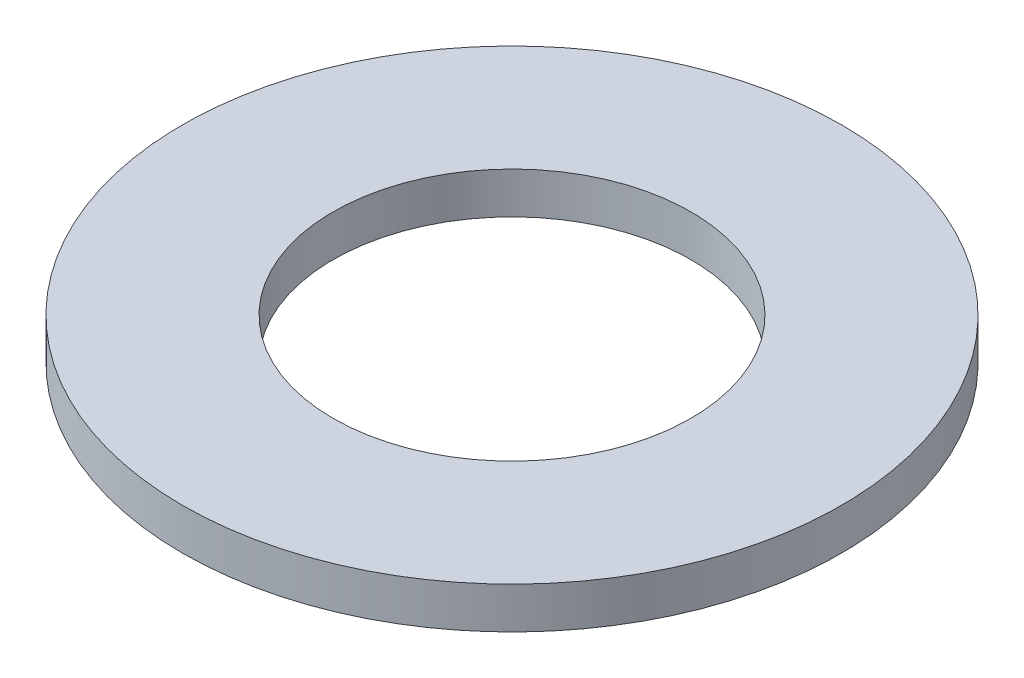
ISO-10303-21;
HEADER;
FILE_DESCRIPTION(('STEP AP214'),'2;1');
FILE_NAME('part.step','',(''),(''),'','','');
FILE_SCHEMA(('AUTOMOTIVE_DESIGN { 1 0 10303 214 1 1 1 1 }'));
ENDSEC;
DATA;
#1=APPLICATION_CONTEXT('core data for automotive mechanical design processes');
#2=APPLICATION_PROTOCOL_DEFINITION('international standard','automotive_design',2000,#1);
#3=PRODUCT_CONTEXT('',#1,'mechanical');
#4=PRODUCT('Part','Part','',(#3));
#5=PRODUCT_RELATED_PRODUCT_CATEGORY('part','',(#4));
#6=PRODUCT_DEFINITION_FORMATION('','',#4);
#7=PRODUCT_DEFINITION_CONTEXT('part definition',#1,'design');
#8=PRODUCT_DEFINITION('design','',#6,#7);
#9=PRODUCT_DEFINITION_SHAPE('','',#8);
#10=(LENGTH_UNIT() NAMED_UNIT(*) SI_UNIT(.MILLI.,.METRE.));
#11=(NAMED_UNIT(*) PLANE_ANGLE_UNIT() SI_UNIT($,.RADIAN.));
#12=(NAMED_UNIT(*) SI_UNIT($,.STERADIAN.) SOLID_ANGLE_UNIT());
#13=UNCERTAINTY_MEASURE_WITH_UNIT(LENGTH_MEASURE(1.E-05),#10,'distance_accuracy_value','');
#14=(GEOMETRIC_REPRESENTATION_CONTEXT(3) GLOBAL_UNCERTAINTY_ASSIGNED_CONTEXT((#13)) GLOBAL_UNIT_ASSIGNED_CONTEXT((#10,
#11,#12)) REPRESENTATION_CONTEXT('',''));
#15=CARTESIAN_POINT('',(0.,0.,0.));
#16=DIRECTION('',(0.,0.,1.));
#17=DIRECTION('',(1.,0.,0.));
#18=AXIS2_PLACEMENT_3D('',#15,#16,#17);
#19=CARTESIAN_POINT('',(0.,11.,0.));
#20=DIRECTION('',(0.,-1.,0.));
#21=DIRECTION('',(0.,0.,-1.));
#22=AXIS2_PLACEMENT_3D('',#19,#20,#21);
#23=CYLINDRICAL_SURFACE('',#22,87.5);
#24=CARTESIAN_POINT('',(0.,11.,0.));
#25=DIRECTION('',(0.,1.,0.));
#26=DIRECTION('',(0.,0.,1.));
#27=AXIS2_PLACEMENT_3D('',#24,#25,#26);
#28=CIRCLE('',#27,87.5);
#29=CARTESIAN_POINT('',(0.,11.,87.5));
#30=VERTEX_POINT('',#29);
#31=EDGE_CURVE('E10',#30,#30,#28,.T.);
#32=ORIENTED_EDGE('',*,*,#31,.F.);
#33=EDGE_LOOP('',(#32));
#34=FACE_BOUND('',#33,.T.);
#35=CARTESIAN_POINT('',(0.,0.,0.));
#36=DIRECTION('',(0.,1.,0.));
#37=DIRECTION('',(0.,0.,1.));
#38=AXIS2_PLACEMENT_3D('',#35,#36,#37);
#39=CIRCLE('',#38,87.5);
#40=CARTESIAN_POINT('',(0.,0.,87.5));
#41=VERTEX_POINT('',#40);
#42=EDGE_CURVE('E37',#41,#41,#39,.T.);
#43=ORIENTED_EDGE('',*,*,#42,.T.);
#44=EDGE_LOOP('',(#43));
#45=FACE_BOUND('',#44,.T.);
#46=ADVANCED_FACE('F40',(#34,#45),#23,.T.);
#47=CARTESIAN_POINT('',(0.,11.,0.));
#48=DIRECTION('',(0.,1.,0.));
#49=DIRECTION('',(0.,0.,1.));
#50=AXIS2_PLACEMENT_3D('',#47,#48,#49);
#51=PLANE('',#50);
#52=CARTESIAN_POINT('',(0.,11.,0.));
#53=DIRECTION('',(0.,1.,0.));
#54=DIRECTION('',(0.,0.,1.));
#55=AXIS2_PLACEMENT_3D('',#52,#53,#54);
#56=CIRCLE('',#55,47.5);
#57=CARTESIAN_POINT('',(0.,11.,47.5));
#58=VERTEX_POINT('',#57);
#59=EDGE_CURVE('E50',#58,#58,#56,.T.);
#60=ORIENTED_EDGE('',*,*,#59,.F.);
#61=EDGE_LOOP('',(#60));
#62=FACE_BOUND('',#61,.T.);
#63=ORIENTED_EDGE('',*,*,#31,.T.);
#64=EDGE_LOOP('',(#63));
#65=FACE_BOUND('',#64,.T.);
#66=ADVANCED_FACE('F59',(#62,#65),#51,.T.);
#67=CARTESIAN_POINT('',(0.,0.,0.));
#68=DIRECTION('',(0.,1.,0.));
#69=DIRECTION('',(0.,0.,1.));
#70=AXIS2_PLACEMENT_3D('',#67,#68,#69);
#71=PLANE('',#70);
#72=CARTESIAN_POINT('',(0.,0.,0.));
#73=DIRECTION('',(0.,1.,0.));
#74=DIRECTION('',(0.,0.,1.));
#75=AXIS2_PLACEMENT_3D('',#72,#73,#74);
#76=CIRCLE('',#75,47.5);
#77=CARTESIAN_POINT('',(0.,0.,47.5));
#78=VERTEX_POINT('',#77);
#79=EDGE_CURVE('E47',#78,#78,#76,.T.);
#80=ORIENTED_EDGE('',*,*,#79,.T.);
#81=EDGE_LOOP('',(#80));
#82=FACE_BOUND('',#81,.T.);
#83=ORIENTED_EDGE('',*,*,#42,.F.);
#84=EDGE_LOOP('',(#83));
#85=FACE_BOUND('',#84,.T.);
#86=ADVANCED_FACE('F58',(#82,#85),#71,.F.);
#87=CARTESIAN_POINT('',(0.,11.,0.));
#88=DIRECTION('',(0.,-1.,0.));
#89=DIRECTION('',(0.,0.,-1.));
#90=AXIS2_PLACEMENT_3D('',#87,#88,#89);
#91=CYLINDRICAL_SURFACE('',#90,47.5);
#92=ORIENTED_EDGE('',*,*,#59,.T.);
#93=EDGE_LOOP('',(#92));
#94=FACE_BOUND('',#93,.T.);
#95=ORIENTED_EDGE('',*,*,#79,.F.);
#96=EDGE_LOOP('',(#95));
#97=FACE_BOUND('',#96,.T.);
#98=ADVANCED_FACE('F54',(#94,#97),#91,.F.);
#99=CLOSED_SHELL('',(#46,#66,#86,#98));
#100=MANIFOLD_SOLID_BREP('B2',#99);
#101=ADVANCED_BREP_SHAPE_REPRESENTATION('',(#18,#100),#14);
#102=SHAPE_DEFINITION_REPRESENTATION(#9,#101);
ENDSEC;
END-ISO-10303-21;
